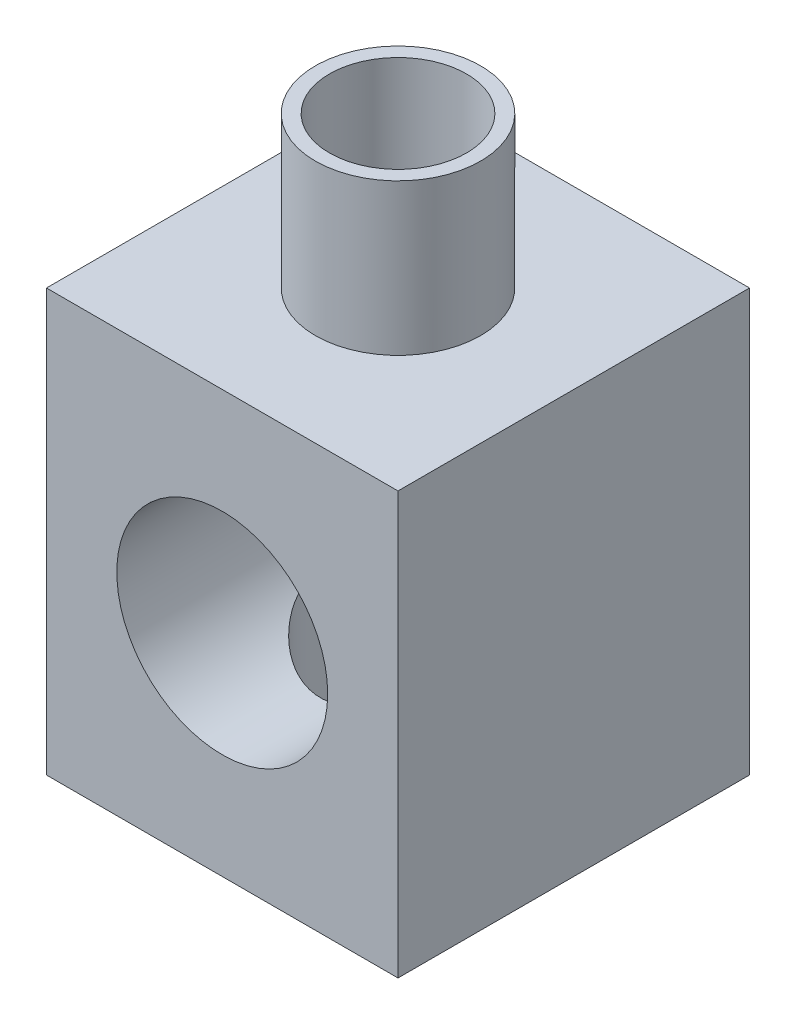
ISO-10303-21;
HEADER;
FILE_DESCRIPTION(('STEP AP214'),'2;1');
FILE_NAME('part.step','',(''),(''),'','','');
FILE_SCHEMA(('AUTOMOTIVE_DESIGN { 1 0 10303 214 1 1 1 1 }'));
ENDSEC;
DATA;
#1=APPLICATION_CONTEXT('core data for automotive mechanical design processes');
#2=APPLICATION_PROTOCOL_DEFINITION('international standard','automotive_design',2000,#1);
#3=PRODUCT_CONTEXT('',#1,'mechanical');
#4=PRODUCT('Part','Part','',(#3));
#5=PRODUCT_RELATED_PRODUCT_CATEGORY('part','',(#4));
#6=PRODUCT_DEFINITION_FORMATION('','',#4);
#7=PRODUCT_DEFINITION_CONTEXT('part definition',#1,'design');
#8=PRODUCT_DEFINITION('design','',#6,#7);
#9=PRODUCT_DEFINITION_SHAPE('','',#8);
#10=(LENGTH_UNIT() NAMED_UNIT(*) SI_UNIT(.MILLI.,.METRE.));
#11=(NAMED_UNIT(*) PLANE_ANGLE_UNIT() SI_UNIT($,.RADIAN.));
#12=(NAMED_UNIT(*) SI_UNIT($,.STERADIAN.) SOLID_ANGLE_UNIT());
#13=UNCERTAINTY_MEASURE_WITH_UNIT(LENGTH_MEASURE(1.E-05),#10,'distance_accuracy_value','');
#14=(GEOMETRIC_REPRESENTATION_CONTEXT(3) GLOBAL_UNCERTAINTY_ASSIGNED_CONTEXT((#13)) GLOBAL_UNIT_ASSIGNED_CONTEXT((#10,
#11,#12)) REPRESENTATION_CONTEXT('',''));
#15=CARTESIAN_POINT('',(0.,0.,0.));
#16=DIRECTION('',(0.,0.,1.));
#17=DIRECTION('',(1.,0.,0.));
#18=AXIS2_PLACEMENT_3D('',#15,#16,#17);
#19=CARTESIAN_POINT('',(0.,0.,0.));
#20=DIRECTION('',(0.,-1.,0.));
#21=DIRECTION('',(0.,0.,-1.));
#22=AXIS2_PLACEMENT_3D('',#19,#20,#21);
#23=PLANE('',#22);
#24=DIRECTION('',(0.,0.,-1.));
#25=VECTOR('',#24,1.);
#26=CARTESIAN_POINT('',(25.,0.,25.));
#27=LINE('',#26,#25);
#28=CARTESIAN_POINT('',(25.,0.,25.));
#29=VERTEX_POINT('',#28);
#30=CARTESIAN_POINT('',(25.,0.,-25.));
#31=VERTEX_POINT('',#30);
#32=EDGE_CURVE('E100',#29,#31,#27,.T.);
#33=ORIENTED_EDGE('',*,*,#32,.F.);
#34=DIRECTION('',(1.,0.,0.));
#35=VECTOR('',#34,1.);
#36=CARTESIAN_POINT('',(-25.,0.,25.));
#37=LINE('',#36,#35);
#38=CARTESIAN_POINT('',(-25.,0.,25.));
#39=VERTEX_POINT('',#38);
#40=EDGE_CURVE('E75',#39,#29,#37,.T.);
#41=ORIENTED_EDGE('',*,*,#40,.F.);
#42=DIRECTION('',(0.,0.,1.));
#43=VECTOR('',#42,1.);
#44=CARTESIAN_POINT('',(-25.,0.,25.));
#45=LINE('',#44,#43);
#46=CARTESIAN_POINT('',(-25.,0.,-25.));
#47=VERTEX_POINT('',#46);
#48=EDGE_CURVE('E69',#47,#39,#45,.T.);
#49=ORIENTED_EDGE('',*,*,#48,.F.);
#50=DIRECTION('',(-1.,0.,0.));
#51=VECTOR('',#50,1.);
#52=CARTESIAN_POINT('',(-25.,0.,-25.));
#53=LINE('',#52,#51);
#54=EDGE_CURVE('E91',#31,#47,#53,.T.);
#55=ORIENTED_EDGE('',*,*,#54,.F.);
#56=EDGE_LOOP('',(#33,#41,#49,#55));
#57=FACE_BOUND('',#56,.T.);
#58=CARTESIAN_POINT('',(0.,0.,0.));
#59=DIRECTION('',(0.,-1.,0.));
#60=DIRECTION('',(0.,0.,-1.));
#61=AXIS2_PLACEMENT_3D('',#58,#59,#60);
#62=CIRCLE('',#61,13.);
#63=CARTESIAN_POINT('',(0.,0.,-13.));
#64=VERTEX_POINT('',#63);
#65=EDGE_CURVE('E222',#64,#64,#62,.T.);
#66=ORIENTED_EDGE('',*,*,#65,.F.);
#67=EDGE_LOOP('',(#66));
#68=FACE_BOUND('',#67,.T.);
#69=ADVANCED_FACE('F33',(#57,#68),#23,.T.);
#70=CARTESIAN_POINT('',(0.,60.,0.));
#71=DIRECTION('',(0.,-1.,0.));
#72=DIRECTION('',(0.,0.,-1.));
#73=AXIS2_PLACEMENT_3D('',#70,#71,#72);
#74=CYLINDRICAL_SURFACE('',#73,11.);
#75=CARTESIAN_POINT('',(0.,45.,-11.));
#76=CARTESIAN_POINT('',(-0.270110744197477,44.9999974608303,-10.9999973598132));
#77=CARTESIAN_POINT('',(-0.540289031083577,44.9926861475496,-10.9900330358975));
#78=CARTESIAN_POINT('',(-1.07852298256454,44.9636061420586,-10.9503281218805));
#79=CARTESIAN_POINT('',(-1.34657728425868,44.9418288249369,-10.9205757337395));
#80=CARTESIAN_POINT('',(-1.87890045413597,44.8842720546229,-10.8416919257174));
#81=CARTESIAN_POINT('',(-2.14315966567923,44.8484618144854,-10.7925178946518));
#82=CARTESIAN_POINT('',(-2.66531023246231,44.763674502164,-10.6755657933803));
#83=CARTESIAN_POINT('',(-2.92320244425288,44.7146992117258,-10.607790240661));
#84=CARTESIAN_POINT('',(-3.42948944014934,44.6049752088188,-10.4550516437199));
#85=CARTESIAN_POINT('',(-3.67793191713288,44.5442988853811,-10.3701941430889));
#86=CARTESIAN_POINT('',(-4.1656309237487,44.4121947207521,-10.1840881835199));
#87=CARTESIAN_POINT('',(-4.40488717106104,44.3407665494561,-10.0828392213221));
#88=CARTESIAN_POINT('',(-4.87303226666782,44.1885203494891,-9.86509828923477));
#89=CARTESIAN_POINT('',(-5.10192760037114,44.1077083108457,-9.74861603731929));
#90=CARTESIAN_POINT('',(-5.54882577953709,43.9379946123471,-9.5013567537479));
#91=CARTESIAN_POINT('',(-5.76682453137718,43.8490899471205,-9.37057440778556));
#92=CARTESIAN_POINT('',(-6.21064733538029,43.656193400344,-9.08317046167074));
#93=CARTESIAN_POINT('',(-6.43537264867267,43.5515649961739,-8.92528014473491));
#94=CARTESIAN_POINT('',(-6.87057511640613,43.3361971657123,-8.59475849888054));
#95=CARTESIAN_POINT('',(-7.08105186451837,43.2254575653102,-8.4221267498952));
#96=CARTESIAN_POINT('',(-7.48771876466872,42.999548106547,-8.06274275394945));
#97=CARTESIAN_POINT('',(-7.68388582881398,42.8843715276567,-7.87596863696921));
#98=CARTESIAN_POINT('',(-8.06122930431745,42.6517078394712,-7.48929574231134));
#99=CARTESIAN_POINT('',(-8.24240850547928,42.5342211652332,-7.28939941964886));
#100=CARTESIAN_POINT('',(-8.6233142410747,42.2760397806092,-6.83682271283393));
#101=CARTESIAN_POINT('',(-8.81979378479981,42.1352758274895,-6.58143814538193));
#102=CARTESIAN_POINT('',(-9.19042709985845,41.8570551079099,-6.05311541619334));
#103=CARTESIAN_POINT('',(-9.36457441779558,41.7195993066941,-5.78017221455917));
#104=CARTESIAN_POINT('',(-9.68936475286764,41.4525262357434,-5.21743671570999));
#105=CARTESIAN_POINT('',(-9.84003382638042,41.3229003755644,-4.92766359410242));
#106=CARTESIAN_POINT('',(-10.1166566012415,41.0764412935123,-4.33141342721813));
#107=CARTESIAN_POINT('',(-10.2426241348075,40.9596009283906,-4.02494585396985));
#108=CARTESIAN_POINT('',(-10.4303849301875,40.7804395515241,-3.50094875371494));
#109=CARTESIAN_POINT('',(-10.4995736032209,40.7129272363569,-3.28782295039842));
#110=CARTESIAN_POINT('',(-10.6254261964559,40.5881146036255,-2.85500892750825));
#111=CARTESIAN_POINT('',(-10.6820940650719,40.5308110678474,-2.63532280159926));
#112=CARTESIAN_POINT('',(-10.7820817039136,40.428415027612,-2.19056144666434));
#113=CARTESIAN_POINT('',(-10.8254262036775,40.3832999192711,-1.96549704776561));
#114=CARTESIAN_POINT('',(-10.8981900385325,40.3069030128415,-1.5107793166227));
#115=CARTESIAN_POINT('',(-10.9276094387772,40.2756211500289,-1.28112600585465));
#116=CARTESIAN_POINT('',(-10.9721120539284,40.228090680293,-0.817016430647307));
#117=CARTESIAN_POINT('',(-10.9870803167889,40.2119626416432,-0.582536566657302));
#118=CARTESIAN_POINT('',(-11.0019364554479,40.1959559553537,-0.112547162599083));
#119=CARTESIAN_POINT('',(-11.0018249298077,40.1960766627533,0.122962336228832));
#120=CARTESIAN_POINT('',(-10.9865202663755,40.2125655147182,0.593051318056399));
#121=CARTESIAN_POINT('',(-10.9713182555288,40.2289432182349,0.827630172372136));
#122=CARTESIAN_POINT('',(-10.9261644825523,40.2771595262055,1.29374903509207));
#123=CARTESIAN_POINT('',(-10.8962110829152,40.3089998471127,1.52528870319514));
#124=CARTESIAN_POINT('',(-10.8181280568705,40.3909399355534,2.00856284757364));
#125=CARTESIAN_POINT('',(-10.7683790418364,40.4426459109178,2.25976300863489));
#126=CARTESIAN_POINT('',(-10.652520392373,40.5608077917485,2.75472275291847));
#127=CARTESIAN_POINT('',(-10.5864084566221,40.6272657718373,2.99848128410992));
#128=CARTESIAN_POINT('',(-10.364772215534,40.8450085016431,3.71799867113453));
#129=CARTESIAN_POINT('',(-10.1860597630495,41.0145359650604,4.18133017627947));
#130=CARTESIAN_POINT('',(-9.8411703503398,41.3219346670771,4.92553974275099));
#131=CARTESIAN_POINT('',(-9.68976441919441,41.4522116638623,5.21681177433259));
#132=CARTESIAN_POINT('',(-9.36334099036477,41.7205994354936,5.7822415570141));
#133=CARTESIAN_POINT('',(-9.1883158317063,41.858712743614,6.05639371284691));
#134=CARTESIAN_POINT('',(-8.81551764459025,42.1384116731292,6.5872600446896));
#135=CARTESIAN_POINT('',(-8.61772346084422,42.2800004259911,6.84395764525848));
#136=CARTESIAN_POINT('',(-8.20017083391706,42.5626731720633,7.33907558108593));
#137=CARTESIAN_POINT('',(-7.98041489964976,42.7037572210279,7.57749799861803));
#138=CARTESIAN_POINT('',(-7.51615333610881,42.983912732607,8.03840395938117));
#139=CARTESIAN_POINT('',(-7.27134120874007,43.1229273748925,8.26061387485754));
#140=CARTESIAN_POINT('',(-6.76014190729572,43.3934351502863,8.68392747509128));
#141=CARTESIAN_POINT('',(-6.49375243104769,43.5249274782486,8.88502890243165));
#142=CARTESIAN_POINT('',(-5.94075048317126,43.7767782862489,9.26388670594736));
#143=CARTESIAN_POINT('',(-5.6541783280695,43.8971579117117,9.44168770098712));
#144=CARTESIAN_POINT('',(-5.06162496703923,44.1237549894301,9.772150015994));
#145=CARTESIAN_POINT('',(-4.75565109783594,44.2299777485021,9.92482076131319));
#146=CARTESIAN_POINT('',(-4.20679991040777,44.4001034413105,10.1670234614025));
#147=CARTESIAN_POINT('',(-3.96782078515358,44.4678790152882,10.2627137403946));
#148=CARTESIAN_POINT('',(-3.48124329882184,44.5926000635484,10.4378042311076));
#149=CARTESIAN_POINT('',(-3.23364685730742,44.6495479317356,10.5172080439209));
#150=CARTESIAN_POINT('',(-2.73127838202087,44.7514667945713,10.6587138232829));
#151=CARTESIAN_POINT('',(-2.47651015327192,44.7964440126414,10.7208247809921));
#152=CARTESIAN_POINT('',(-1.96128766488453,44.8735062826463,10.8269349755309));
#153=CARTESIAN_POINT('',(-1.70083325971851,44.9055910042116,10.8709337482377));
#154=CARTESIAN_POINT('',(-1.17508411102072,44.9562425011795,10.940281264288));
#155=CARTESIAN_POINT('',(-0.909774316596427,44.9747554033694,10.9655556856344));
#156=CARTESIAN_POINT('',(-0.377406380703509,44.9976179736679,10.9967567120282));
#157=CARTESIAN_POINT('',(-0.110348241893038,45.001967663305,11.0026833464849));
#158=CARTESIAN_POINT('',(0.423344197860635,44.9963995178058,10.9950900302047));
#159=CARTESIAN_POINT('',(0.689978491736684,44.9864814472171,10.9815697585472));
#160=CARTESIAN_POINT('',(1.22066272749612,44.9526142327057,10.9353061623393));
#161=CARTESIAN_POINT('',(1.4847127469152,44.9286655110634,10.9025634163272));
#162=CARTESIAN_POINT('',(1.99230010982735,44.8691638529147,10.8209408699265));
#163=CARTESIAN_POINT('',(2.23610939080497,44.8344038983366,10.7731617380553));
#164=CARTESIAN_POINT('',(2.71816244025099,44.7536881426195,10.6617441545321));
#165=CARTESIAN_POINT('',(2.95640648231444,44.7077328931317,10.5981064843105));
#166=CARTESIAN_POINT('',(3.42603301999851,44.6054802709523,10.4557403377154));
#167=CARTESIAN_POINT('',(3.6574159053783,44.5491834870404,10.3770127204546));
#168=CARTESIAN_POINT('',(4.11235082689498,44.4271987050362,10.2052788171933));
#169=CARTESIAN_POINT('',(4.33589994377809,44.3615072513952,10.1122672763448));
#170=CARTESIAN_POINT('',(4.79159787740789,44.2162658396186,9.90495398664861));
#171=CARTESIAN_POINT('',(5.02302608318197,44.1360304158281,9.78954961237338));
#172=CARTESIAN_POINT('',(5.4749512770416,43.9672162180581,9.54416372382621));
#173=CARTESIAN_POINT('',(5.69544366423045,43.8786339771155,9.41417614791346));
#174=CARTESIAN_POINT('',(6.12486520015845,43.6945468035205,9.14061564171081));
#175=CARTESIAN_POINT('',(6.33379159958489,43.5990402372648,8.99703950311911));
#176=CARTESIAN_POINT('',(6.73962347311303,43.4025489444866,8.6971917133044));
#177=CARTESIAN_POINT('',(6.93652745590328,43.3015635412682,8.5409184926626));
#178=CARTESIAN_POINT('',(7.35294580934229,43.0766950252305,8.1866951979862));
#179=CARTESIAN_POINT('',(7.56999539027636,42.9520059139339,7.98635432383585));
#180=CARTESIAN_POINT('',(7.98643942077465,42.6994528355065,7.56990923706893));
#181=CARTESIAN_POINT('',(8.18583116706011,42.5715883860792,7.35380262004251));
#182=CARTESIAN_POINT('',(8.56673045749969,42.3151888067265,6.90634040492952));
#183=CARTESIAN_POINT('',(8.7482217973263,42.1866531780389,6.6749713009497));
#184=CARTESIAN_POINT('',(9.09263414138609,41.9318844928923,6.19762981055959));
#185=CARTESIAN_POINT('',(9.25555735428008,41.8056511640805,5.9516591662931));
#186=CARTESIAN_POINT('',(9.5466769720951,41.5711830663914,5.47098857588198));
#187=CARTESIAN_POINT('',(9.67671904693761,41.4624191630785,5.23766462148889));
#188=CARTESIAN_POINT('',(9.92061312961937,41.2519941371151,4.75956357248533));
#189=CARTESIAN_POINT('',(10.0344643903335,41.1503333423477,4.51478595003758));
#190=CARTESIAN_POINT('',(10.2448778133162,40.9573187225254,4.01447427504347));
#191=CARTESIAN_POINT('',(10.3414679144767,40.8659483317442,3.7589584469144));
#192=CARTESIAN_POINT('',(10.5163951645491,40.696740456234,3.23743689867137));
#193=CARTESIAN_POINT('',(10.5947399798539,40.6188972910718,2.97143563951238));
#194=CARTESIAN_POINT('',(10.7161005953447,40.4962293358489,2.49227930580472));
#195=CARTESIAN_POINT('',(10.7630978451311,40.4479273474125,2.28101908894396));
#196=CARTESIAN_POINT('',(10.8448258259195,40.3630705776004,1.85390952792791));
#197=CARTESIAN_POINT('',(10.8795637486937,40.3265089100588,1.63806295336276));
#198=CARTESIAN_POINT('',(10.9362045600377,40.266505757041,1.20310813816774));
#199=CARTESIAN_POINT('',(10.9581212707429,40.2430501435791,0.984003672139265));
#200=CARTESIAN_POINT('',(10.9887642181428,40.2101700764594,0.543810890515307));
#201=CARTESIAN_POINT('',(10.9974904225618,40.2007456571346,0.322722570066859));
#202=CARTESIAN_POINT('',(11.001577730153,40.1963374779368,-0.120236354253128));
#203=CARTESIAN_POINT('',(10.9969078378347,40.2013872078989,-0.342107584095333));
#204=CARTESIAN_POINT('',(10.974233744487,40.2257745530489,-0.784363706971924));
#205=CARTESIAN_POINT('',(10.9562296255898,40.2451120802309,-1.00474860915293));
#206=CARTESIAN_POINT('',(10.9072123246648,40.297280820028,-1.44267986976684));
#207=CARTESIAN_POINT('',(10.8761849079364,40.3301267968282,-1.66022285283719));
#208=CARTESIAN_POINT('',(10.8016529141427,40.408034823447,-2.09095661163474));
#209=CARTESIAN_POINT('',(10.758145127813,40.453100015212,-2.30414625279833));
#210=CARTESIAN_POINT('',(10.6451091285833,40.5683441570994,-2.78550384026919));
#211=CARTESIAN_POINT('',(10.5716973186313,40.6420191713655,-3.0519263332905));
#212=CARTESIAN_POINT('',(10.4066007199771,40.8035167601752,-3.57461208753826));
#213=CARTESIAN_POINT('',(10.3149103503141,40.8913436541136,-3.83087221718635));
#214=CARTESIAN_POINT('',(10.1142364448847,41.0779522214145,-4.3330705541883));
#215=CARTESIAN_POINT('',(10.0052156009968,41.1767573868237,-4.57898501158382));
#216=CARTESIAN_POINT('',(9.77098939880929,41.3820926684221,-5.05956860434713));
#217=CARTESIAN_POINT('',(9.64578370411759,41.4886229451528,-5.29423750584396));
#218=CARTESIAN_POINT('',(9.34379854918015,41.7363189510665,-5.81436004275057));
#219=CARTESIAN_POINT('',(9.16224442693568,41.879037851564,-6.09631113298266));
#220=CARTESIAN_POINT('',(8.77512208496417,42.1678098142591,-6.64146271614016));
#221=CARTESIAN_POINT('',(8.56954728756618,42.3138637808596,-6.90465804119156));
#222=CARTESIAN_POINT('',(8.13522031697478,42.6050194061752,-7.41144266146274));
#223=CARTESIAN_POINT('',(7.90648153236523,42.7501215639646,-7.65504313787453));
#224=CARTESIAN_POINT('',(7.42631302236132,43.0356382882479,-8.12169325353109));
#225=CARTESIAN_POINT('',(7.17488901333287,43.1760540235067,-8.34474804153731));
#226=CARTESIAN_POINT('',(6.69115256817232,43.4272359227161,-8.73552414547329));
#227=CARTESIAN_POINT('',(6.46203294364468,43.5391969321934,-8.90643572676668));
#228=CARTESIAN_POINT('',(5.98860620208572,43.7551538545753,-9.2314137838971));
#229=CARTESIAN_POINT('',(5.74430158432136,43.8591510719681,-9.38548302032597));
#230=CARTESIAN_POINT('',(5.24139468689524,44.0570534959253,-9.6753269703283));
#231=CARTESIAN_POINT('',(4.98280222880867,44.1509655075815,-9.81111403587453));
#232=CARTESIAN_POINT('',(4.45226540129276,44.3267362752663,-10.0629771089296));
#233=CARTESIAN_POINT('',(4.18032354579017,44.408597289187,-10.1790568094647));
#234=CARTESIAN_POINT('',(3.66616342350025,44.5471359201621,-10.3741573451725));
#235=CARTESIAN_POINT('',(3.42558156937486,44.6057488698396,-10.4561241668229));
#236=CARTESIAN_POINT('',(2.93706315480403,44.7117672617522,-10.6037132524074));
#237=CARTESIAN_POINT('',(2.68912794268373,44.759174744517,-10.6693384922809));
#238=CARTESIAN_POINT('',(2.18787416914334,44.8417517724116,-10.7832802445943));
#239=CARTESIAN_POINT('',(1.93456816798543,44.8769471110713,-10.8316332445519));
#240=CARTESIAN_POINT('',(1.42384932104133,44.9344774108996,-10.9105154998498));
#241=CARTESIAN_POINT('',(1.16643872476616,44.9568191832511,-10.9410541952181));
#242=CARTESIAN_POINT('',(0.75712601817307,44.9816426567374,-10.9749569849538));
#243=CARTESIAN_POINT('',(0.605954225695025,44.9885206400486,-10.984342017959));
#244=CARTESIAN_POINT('',(0.303195414754704,44.9977003111228,-10.996864658023));
#245=CARTESIAN_POINT('',(0.151608346623402,45.0000014251907,-11.0000014818898));
#246=CARTESIAN_POINT('',(0.,45.,-11.));
#247=B_SPLINE_CURVE_WITH_KNOTS('',3,(#75,#76,#77,#78,#79,#80,#81,#82,#83,#84,#85,#86,#87,#88,
#89,#90,#91,#92,#93,#94,#95,#96,#97,#98,#99,#100,#101,#102,#103,#104,#105,#106,#107,#108,#109,
#110,#111,#112,#113,#114,#115,#116,#117,#118,#119,#120,#121,#122,#123,#124,#125,#126,#127,#128,
#129,#130,#131,#132,#133,#134,#135,#136,#137,#138,#139,#140,#141,#142,#143,#144,#145,#146,#147,
#148,#149,#150,#151,#152,#153,#154,#155,#156,#157,#158,#159,#160,#161,#162,#163,#164,#165,#166,
#167,#168,#169,#170,#171,#172,#173,#174,#175,#176,#177,#178,#179,#180,#181,#182,#183,#184,#185,
#186,#187,#188,#189,#190,#191,#192,#193,#194,#195,#196,#197,#198,#199,#200,#201,#202,#203,#204,
#205,#206,#207,#208,#209,#210,#211,#212,#213,#214,#215,#216,#217,#218,#219,#220,#221,#222,#223,
#224,#225,#226,#227,#228,#229,#230,#231,#232,#233,#234,#235,#236,#237,#238,#239,#240,#241,#242,
#243,#244,#245,#246),.UNSPECIFIED.,.T.,.F.,(4,2,2,2,2,2,2,2,2,2,2,2,2,2,2,2,2,2,2,2,2,2,2,2,2,2,
2,2,2,2,2,2,2,2,2,2,2,2,2,2,2,2,2,2,2,2,2,2,2,2,2,2,2,2,2,2,2,2,2,2,2,2,2,2,2,2,2,2,2,2,2,2,2,2,
2,2,2,2,2,2,2,2,2,2,2,4),(0.,0.810169357085883,1.62082218688859,2.43326356231595,
3.24559503799466,4.05305348505196,4.86053672785752,5.66750733237119,6.47477885511227,
7.35565368833111,8.23655363103995,9.11884478509551,10.0009713403942,11.054678178616,
12.1086888261328,13.1615212611752,14.2137624433261,14.915276753358,15.6165695253124,
16.3165526545416,17.016532508614,17.7220355879629,18.4275106638218,19.1334007978426,
19.8393693082743,20.6219285659296,21.4045979472486,22.9719812598272,24.0304407604573,
25.0892444048054,26.1490398743093,27.2087144107119,28.2833999281832,29.3582002595085,
30.4309113659766,31.5032192201074,32.3010322348245,33.0986686548839,33.8958895780711,
34.6931309286872,35.4935200351391,36.2939079249769,37.0943090232898,37.8946860331837,
38.646459903409,39.3981967372506,40.1498907853306,40.9018620361347,41.7133743758931,
42.5252252867152,43.3372683585193,44.1494119557932,45.1103152385431,46.071365374808,
47.033277666074,47.9950754191168,48.8596018773335,49.7241682161878,50.5873222378104,
51.4501129181483,52.1147349620882,52.7789664636287,53.4424805526333,54.1059962651878,
54.7710484380972,55.4360965146436,56.1018734015416,56.7678216433323,57.6245407809539,
58.4815219008917,59.3403735107737,60.199242974229,61.2912128551912,62.3834824582019,
63.4751243036081,64.5664918343885,65.4865880398675,66.4065332075521,67.325853680381,
68.2450016881881,69.0266992912611,69.8082544363545,70.5881486477637,71.3676292069321,
71.822305839083,72.2770394598343),.UNSPECIFIED.);
#248=CARTESIAN_POINT('',(0.,45.,-11.));
#249=VERTEX_POINT('',#248);
#250=EDGE_CURVE('E103',#249,#249,#247,.T.);
#251=ORIENTED_EDGE('',*,*,#250,.F.);
#252=EDGE_LOOP('',(#251));
#253=FACE_BOUND('',#252,.T.);
#254=CARTESIAN_POINT('',(0.,55.,0.));
#255=DIRECTION('',(0.,1.,0.));
#256=DIRECTION('',(0.,0.,1.));
#257=AXIS2_PLACEMENT_3D('',#254,#255,#256);
#258=CIRCLE('',#257,11.);
#259=CARTESIAN_POINT('',(0.,55.,11.));
#260=VERTEX_POINT('',#259);
#261=EDGE_CURVE('E37',#260,#260,#258,.T.);
#262=ORIENTED_EDGE('',*,*,#261,.T.);
#263=EDGE_LOOP('',(#262));
#264=FACE_BOUND('',#263,.T.);
#265=ADVANCED_FACE('F167',(#253,#264),#74,.F.);
#266=CARTESIAN_POINT('',(0.,60.,0.));
#267=DIRECTION('',(0.,-1.,0.));
#268=DIRECTION('',(0.,0.,-1.));
#269=AXIS2_PLACEMENT_3D('',#266,#267,#268);
#270=PLANE('',#269);
#271=CARTESIAN_POINT('',(0.,60.,0.));
#272=DIRECTION('',(0.,-1.,0.));
#273=DIRECTION('',(0.,0.,-1.));
#274=AXIS2_PLACEMENT_3D('',#271,#272,#273);
#275=CIRCLE('',#274,11.75);
#276=CARTESIAN_POINT('',(0.,60.,-11.75));
#277=VERTEX_POINT('',#276);
#278=EDGE_CURVE('E198',#277,#277,#275,.T.);
#279=ORIENTED_EDGE('',*,*,#278,.T.);
#280=EDGE_LOOP('',(#279));
#281=FACE_BOUND('',#280,.T.);
#282=DIRECTION('',(0.,0.,-1.));
#283=VECTOR('',#282,1.);
#284=CARTESIAN_POINT('',(25.,60.,25.));
#285=LINE('',#284,#283);
#286=CARTESIAN_POINT('',(25.,60.,25.));
#287=VERTEX_POINT('',#286);
#288=CARTESIAN_POINT('',(25.,60.,-25.));
#289=VERTEX_POINT('',#288);
#290=EDGE_CURVE('E87',#287,#289,#285,.T.);
#291=ORIENTED_EDGE('',*,*,#290,.T.);
#292=DIRECTION('',(-1.,0.,0.));
#293=VECTOR('',#292,1.);
#294=CARTESIAN_POINT('',(-25.,60.,-25.));
#295=LINE('',#294,#293);
#296=CARTESIAN_POINT('',(-25.,60.,-25.));
#297=VERTEX_POINT('',#296);
#298=EDGE_CURVE('E82',#289,#297,#295,.T.);
#299=ORIENTED_EDGE('',*,*,#298,.T.);
#300=DIRECTION('',(0.,0.,1.));
#301=VECTOR('',#300,1.);
#302=CARTESIAN_POINT('',(-25.,60.,25.));
#303=LINE('',#302,#301);
#304=CARTESIAN_POINT('',(-25.,60.,25.));
#305=VERTEX_POINT('',#304);
#306=EDGE_CURVE('E85',#297,#305,#303,.T.);
#307=ORIENTED_EDGE('',*,*,#306,.T.);
#308=DIRECTION('',(1.,0.,0.));
#309=VECTOR('',#308,1.);
#310=CARTESIAN_POINT('',(-25.,60.,25.));
#311=LINE('',#310,#309);
#312=EDGE_CURVE('E52',#305,#287,#311,.T.);
#313=ORIENTED_EDGE('',*,*,#312,.T.);
#314=EDGE_LOOP('',(#291,#299,#307,#313));
#315=FACE_BOUND('',#314,.T.);
#316=ADVANCED_FACE('F83',(#281,#315),#270,.F.);
#317=CARTESIAN_POINT('',(25.,60.,25.));
#318=DIRECTION('',(-1.,0.,0.));
#319=DIRECTION('',(0.,0.,1.));
#320=AXIS2_PLACEMENT_3D('',#317,#318,#319);
#321=PLANE('',#320);
#322=ORIENTED_EDGE('',*,*,#32,.T.);
#323=DIRECTION('',(0.,-1.,0.));
#324=VECTOR('',#323,1.);
#325=CARTESIAN_POINT('',(25.,60.,-25.));
#326=LINE('',#325,#324);
#327=EDGE_CURVE('E11',#289,#31,#326,.T.);
#328=ORIENTED_EDGE('',*,*,#327,.F.);
#329=ORIENTED_EDGE('',*,*,#290,.F.);
#330=DIRECTION('',(0.,-1.,0.));
#331=VECTOR('',#330,1.);
#332=CARTESIAN_POINT('',(25.,60.,25.));
#333=LINE('',#332,#331);
#334=EDGE_CURVE('E96',#287,#29,#333,.T.);
#335=ORIENTED_EDGE('',*,*,#334,.T.);
#336=EDGE_LOOP('',(#322,#328,#329,#335));
#337=FACE_BOUND('',#336,.T.);
#338=ADVANCED_FACE('F35',(#337),#321,.F.);
#339=CARTESIAN_POINT('',(-25.,60.,-25.));
#340=DIRECTION('',(0.,0.,1.));
#341=DIRECTION('',(1.,0.,0.));
#342=AXIS2_PLACEMENT_3D('',#339,#340,#341);
#343=PLANE('',#342);
#344=CARTESIAN_POINT('',(0.,30.,-25.));
#345=DIRECTION('',(0.,0.,1.));
#346=DIRECTION('',(1.,0.,0.));
#347=AXIS2_PLACEMENT_3D('',#344,#345,#346);
#348=CIRCLE('',#347,4.);
#349=CARTESIAN_POINT('',(4.,30.,-25.));
#350=VERTEX_POINT('',#349);
#351=EDGE_CURVE('E190',#350,#350,#348,.T.);
#352=ORIENTED_EDGE('',*,*,#351,.T.);
#353=EDGE_LOOP('',(#352));
#354=FACE_BOUND('',#353,.T.);
#355=ORIENTED_EDGE('',*,*,#54,.T.);
#356=DIRECTION('',(0.,-1.,0.));
#357=VECTOR('',#356,1.);
#358=CARTESIAN_POINT('',(-25.,60.,-25.));
#359=LINE('',#358,#357);
#360=EDGE_CURVE('E43',#297,#47,#359,.T.);
#361=ORIENTED_EDGE('',*,*,#360,.F.);
#362=ORIENTED_EDGE('',*,*,#298,.F.);
#363=ORIENTED_EDGE('',*,*,#327,.T.);
#364=EDGE_LOOP('',(#355,#361,#362,#363));
#365=FACE_BOUND('',#364,.T.);
#366=ADVANCED_FACE('F90',(#354,#365),#343,.F.);
#367=CARTESIAN_POINT('',(-25.,60.,25.));
#368=DIRECTION('',(1.,0.,0.));
#369=DIRECTION('',(0.,0.,-1.));
#370=AXIS2_PLACEMENT_3D('',#367,#368,#369);
#371=PLANE('',#370);
#372=ORIENTED_EDGE('',*,*,#48,.T.);
#373=DIRECTION('',(0.,-1.,0.));
#374=VECTOR('',#373,1.);
#375=CARTESIAN_POINT('',(-25.,60.,25.));
#376=LINE('',#375,#374);
#377=EDGE_CURVE('E92',#305,#39,#376,.T.);
#378=ORIENTED_EDGE('',*,*,#377,.F.);
#379=ORIENTED_EDGE('',*,*,#306,.F.);
#380=ORIENTED_EDGE('',*,*,#360,.T.);
#381=EDGE_LOOP('',(#372,#378,#379,#380));
#382=FACE_BOUND('',#381,.T.);
#383=ADVANCED_FACE('F94',(#382),#371,.F.);
#384=CARTESIAN_POINT('',(-25.,60.,25.));
#385=DIRECTION('',(0.,0.,-1.));
#386=DIRECTION('',(-1.,0.,0.));
#387=AXIS2_PLACEMENT_3D('',#384,#385,#386);
#388=PLANE('',#387);
#389=CARTESIAN_POINT('',(0.,30.,25.));
#390=DIRECTION('',(0.,0.,1.));
#391=DIRECTION('',(1.,0.,0.));
#392=AXIS2_PLACEMENT_3D('',#389,#390,#391);
#393=CIRCLE('',#392,15.);
#394=CARTESIAN_POINT('',(15.,30.,25.));
#395=VERTEX_POINT('',#394);
#396=EDGE_CURVE('E192',#395,#395,#393,.T.);
#397=ORIENTED_EDGE('',*,*,#396,.F.);
#398=EDGE_LOOP('',(#397));
#399=FACE_BOUND('',#398,.T.);
#400=ORIENTED_EDGE('',*,*,#40,.T.);
#401=ORIENTED_EDGE('',*,*,#334,.F.);
#402=ORIENTED_EDGE('',*,*,#312,.F.);
#403=ORIENTED_EDGE('',*,*,#377,.T.);
#404=EDGE_LOOP('',(#400,#401,#402,#403));
#405=FACE_BOUND('',#404,.T.);
#406=ADVANCED_FACE('F177',(#399,#405),#388,.F.);
#407=CARTESIAN_POINT('',(0.,15.,-11.));
#408=CARTESIAN_POINT('',(0.270110744197477,15.0000025391697,-10.9999973598132));
#409=CARTESIAN_POINT('',(0.540289031083577,15.0073138524504,-10.9900330358975));
#410=CARTESIAN_POINT('',(1.07852298256454,15.0363938579414,-10.9503281218805));
#411=CARTESIAN_POINT('',(1.34657728425868,15.0581711750631,-10.9205757337395));
#412=CARTESIAN_POINT('',(1.87890045413597,15.1157279453771,-10.8416919257174));
#413=CARTESIAN_POINT('',(2.14315966567923,15.1515381855146,-10.7925178946518));
#414=CARTESIAN_POINT('',(2.66531023246231,15.236325497836,-10.6755657933803));
#415=CARTESIAN_POINT('',(2.92320244425288,15.2853007882742,-10.607790240661));
#416=CARTESIAN_POINT('',(3.42948944014933,15.3950247911812,-10.4550516437199));
#417=CARTESIAN_POINT('',(3.67793191713288,15.4557011146189,-10.3701941430889));
#418=CARTESIAN_POINT('',(4.1656309237487,15.5878052792479,-10.1840881835199));
#419=CARTESIAN_POINT('',(4.40488717106104,15.6592334505439,-10.0828392213221));
#420=CARTESIAN_POINT('',(4.87303226666782,15.8114796505109,-9.86509828923478));
#421=CARTESIAN_POINT('',(5.10192760037114,15.8922916891543,-9.74861603731929));
#422=CARTESIAN_POINT('',(5.54882577953709,16.0620053876529,-9.5013567537479));
#423=CARTESIAN_POINT('',(5.76682453137718,16.1509100528795,-9.37057440778556));
#424=CARTESIAN_POINT('',(6.21064733538029,16.343806599656,-9.08317046167074));
#425=CARTESIAN_POINT('',(6.43537264867267,16.4484350038261,-8.92528014473491));
#426=CARTESIAN_POINT('',(6.87057511640613,16.6638028342877,-8.59475849888054));
#427=CARTESIAN_POINT('',(7.08105186451838,16.7745424346898,-8.4221267498952));
#428=CARTESIAN_POINT('',(7.48771876466872,17.000451893453,-8.06274275394945));
#429=CARTESIAN_POINT('',(7.68388582881399,17.1156284723433,-7.87596863696921));
#430=CARTESIAN_POINT('',(8.06122930431745,17.3482921605288,-7.48929574231134));
#431=CARTESIAN_POINT('',(8.24240850547928,17.4657788347668,-7.28939941964886));
#432=CARTESIAN_POINT('',(8.6233142410747,17.7239602193908,-6.83682271283392));
#433=CARTESIAN_POINT('',(8.81979378479981,17.8647241725105,-6.58143814538193));
#434=CARTESIAN_POINT('',(9.19042709985846,18.1429448920901,-6.05311541619334));
#435=CARTESIAN_POINT('',(9.36457441779559,18.2804006933059,-5.78017221455917));
#436=CARTESIAN_POINT('',(9.68936475286764,18.5474737642566,-5.21743671570999));
#437=CARTESIAN_POINT('',(9.84003382638042,18.6770996244356,-4.92766359410242));
#438=CARTESIAN_POINT('',(10.1166566012415,18.9235587064877,-4.33141342721813));
#439=CARTESIAN_POINT('',(10.2426241348075,19.0403990716094,-4.02494585396985));
#440=CARTESIAN_POINT('',(10.4303849301875,19.2195604484759,-3.50094875371494));
#441=CARTESIAN_POINT('',(10.4995736032209,19.2870727636431,-3.28782295039842));
#442=CARTESIAN_POINT('',(10.6254261964559,19.4118853963745,-2.85500892750825));
#443=CARTESIAN_POINT('',(10.6820940650719,19.4691889321526,-2.63532280159926));
#444=CARTESIAN_POINT('',(10.7820817039136,19.571584972388,-2.19056144666434));
#445=CARTESIAN_POINT('',(10.8254262036775,19.6167000807289,-1.96549704776561));
#446=CARTESIAN_POINT('',(10.8981900385325,19.6930969871585,-1.5107793166227));
#447=CARTESIAN_POINT('',(10.9276094387772,19.7243788499711,-1.28112600585465));
#448=CARTESIAN_POINT('',(10.9721120539284,19.771909319707,-0.81701643064731));
#449=CARTESIAN_POINT('',(10.9870803167889,19.7880373583568,-0.582536566657305));
#450=CARTESIAN_POINT('',(11.0019364554479,19.8040440446463,-0.112547162599087));
#451=CARTESIAN_POINT('',(11.0018249298077,19.8039233372467,0.122962336228828));
#452=CARTESIAN_POINT('',(10.9865202663755,19.7874344852818,0.593051318056394));
#453=CARTESIAN_POINT('',(10.9713182555288,19.7710567817651,0.82763017237213));
#454=CARTESIAN_POINT('',(10.9261644825523,19.7228404737945,1.29374903509207));
#455=CARTESIAN_POINT('',(10.8962110829152,19.6910001528873,1.52528870319514));
#456=CARTESIAN_POINT('',(10.8181280568705,19.6090600644466,2.00856284757364));
#457=CARTESIAN_POINT('',(10.7683790418364,19.5573540890822,2.25976300863489));
#458=CARTESIAN_POINT('',(10.652520392373,19.4391922082515,2.75472275291847));
#459=CARTESIAN_POINT('',(10.5864084566222,19.3727342281627,2.99848128410991));
#460=CARTESIAN_POINT('',(10.364772215534,19.1549914983569,3.71799867113453));
#461=CARTESIAN_POINT('',(10.1860597630495,18.9854640349396,4.18133017627946));
#462=CARTESIAN_POINT('',(9.84117035033981,18.6780653329229,4.92553974275098));
#463=CARTESIAN_POINT('',(9.68976441919442,18.5477883361377,5.21681177433258));
#464=CARTESIAN_POINT('',(9.36334099036478,18.2794005645064,5.78224155701408));
#465=CARTESIAN_POINT('',(9.18831583170631,18.141287256386,6.0563937128469));
#466=CARTESIAN_POINT('',(8.81551764459026,17.8615883268708,6.58726004468959));
#467=CARTESIAN_POINT('',(8.61772346084423,17.7199995740089,6.84395764525847));
#468=CARTESIAN_POINT('',(8.20017083391707,17.4373268279367,7.33907558108592));
#469=CARTESIAN_POINT('',(7.98041489964977,17.2962427789721,7.57749799861801));
#470=CARTESIAN_POINT('',(7.51615333610883,17.016087267393,8.03840395938115));
#471=CARTESIAN_POINT('',(7.27134120874008,16.8770726251075,8.26061387485753));
#472=CARTESIAN_POINT('',(6.76014190729573,16.6065648497137,8.68392747509127));
#473=CARTESIAN_POINT('',(6.4937524310477,16.4750725217514,8.88502890243164));
#474=CARTESIAN_POINT('',(5.94075048317128,16.2232217137511,9.26388670594735));
#475=CARTESIAN_POINT('',(5.65417832806952,16.1028420882883,9.44168770098711));
#476=CARTESIAN_POINT('',(5.06162496703924,15.8762450105699,9.77215001599399));
#477=CARTESIAN_POINT('',(4.75565109783595,15.7700222514979,9.92482076131318));
#478=CARTESIAN_POINT('',(4.20679991040778,15.5998965586895,10.1670234614025));
#479=CARTESIAN_POINT('',(3.96782078515359,15.5321209847118,10.2627137403946));
#480=CARTESIAN_POINT('',(3.48124329882186,15.4073999364516,10.4378042311076));
#481=CARTESIAN_POINT('',(3.23364685730743,15.3504520682644,10.5172080439209));
#482=CARTESIAN_POINT('',(2.73127838202088,15.2485332054287,10.6587138232829));
#483=CARTESIAN_POINT('',(2.47651015327193,15.2035559873586,10.7208247809921));
#484=CARTESIAN_POINT('',(1.96128766488454,15.1264937173537,10.8269349755309));
#485=CARTESIAN_POINT('',(1.70083325971852,15.0944089957884,10.8709337482377));
#486=CARTESIAN_POINT('',(1.17508411102074,15.0437574988204,10.940281264288));
#487=CARTESIAN_POINT('',(0.909774316596437,15.0252445966306,10.9655556856344));
#488=CARTESIAN_POINT('',(0.377406380703518,15.0023820263321,10.9967567120282));
#489=CARTESIAN_POINT('',(0.110348241893049,14.998032336695,11.0026833464849));
#490=CARTESIAN_POINT('',(-0.423344197860622,15.0036004821942,10.9950900302047));
#491=CARTESIAN_POINT('',(-0.689978491736671,15.0135185527829,10.9815697585472));
#492=CARTESIAN_POINT('',(-1.22066272749611,15.0473857672943,10.9353061623393));
#493=CARTESIAN_POINT('',(-1.48471274691519,15.0713344889366,10.9025634163273));
#494=CARTESIAN_POINT('',(-1.99230010982734,15.1308361470853,10.8209408699265));
#495=CARTESIAN_POINT('',(-2.23610939080496,15.1655961016634,10.7731617380553));
#496=CARTESIAN_POINT('',(-2.71816244025098,15.2463118573805,10.6617441545321));
#497=CARTESIAN_POINT('',(-2.95640648231443,15.2922671068683,10.5981064843105));
#498=CARTESIAN_POINT('',(-3.4260330199985,15.3945197290477,10.4557403377154));
#499=CARTESIAN_POINT('',(-3.65741590537829,15.4508165129596,10.3770127204546));
#500=CARTESIAN_POINT('',(-4.11235082689497,15.5728012949638,10.2052788171933));
#501=CARTESIAN_POINT('',(-4.33589994377808,15.6384927486047,10.1122672763448));
#502=CARTESIAN_POINT('',(-4.79159787740788,15.7837341603814,9.90495398664862));
#503=CARTESIAN_POINT('',(-5.02302608318196,15.8639695841719,9.78954961237339));
#504=CARTESIAN_POINT('',(-5.47495127704158,16.0327837819419,9.54416372382622));
#505=CARTESIAN_POINT('',(-5.69544366423043,16.1213660228845,9.41417614791347));
#506=CARTESIAN_POINT('',(-6.12486520015844,16.3054531964795,9.14061564171082));
#507=CARTESIAN_POINT('',(-6.33379159958489,16.4009597627352,8.99703950311911));
#508=CARTESIAN_POINT('',(-6.73962347311303,16.5974510555134,8.6971917133044));
#509=CARTESIAN_POINT('',(-6.93652745590328,16.6984364587318,8.54091849266261));
#510=CARTESIAN_POINT('',(-7.35294580934228,16.9233049747695,8.18669519798621));
#511=CARTESIAN_POINT('',(-7.56999539027635,17.0479940860661,7.98635432383586));
#512=CARTESIAN_POINT('',(-7.98643942077464,17.3005471644935,7.56990923706895));
#513=CARTESIAN_POINT('',(-8.1858311670601,17.4284116139208,7.35380262004252));
#514=CARTESIAN_POINT('',(-8.56673045749968,17.6848111932735,6.90634040492953));
#515=CARTESIAN_POINT('',(-8.74822179732629,17.8133468219611,6.67497130094971));
#516=CARTESIAN_POINT('',(-9.09263414138608,18.0681155071077,6.1976298105596));
#517=CARTESIAN_POINT('',(-9.25555735428007,18.1943488359195,5.95165916629311));
#518=CARTESIAN_POINT('',(-9.54667697209509,18.4288169336086,5.47098857588199));
#519=CARTESIAN_POINT('',(-9.6767190469376,18.5375808369215,5.2376646214889));
#520=CARTESIAN_POINT('',(-9.92061312961937,18.7480058628849,4.75956357248534));
#521=CARTESIAN_POINT('',(-10.0344643903335,18.8496666576523,4.51478595003759));
#522=CARTESIAN_POINT('',(-10.2448778133162,19.0426812774746,4.01447427504348));
#523=CARTESIAN_POINT('',(-10.3414679144767,19.1340516682558,3.75895844691441));
#524=CARTESIAN_POINT('',(-10.5163951645491,19.303259543766,3.23743689867137));
#525=CARTESIAN_POINT('',(-10.5947399798539,19.3811027089282,2.97143563951239));
#526=CARTESIAN_POINT('',(-10.7161005953447,19.5037706641511,2.49227930580472));
#527=CARTESIAN_POINT('',(-10.7630978451311,19.5520726525875,2.28101908894397));
#528=CARTESIAN_POINT('',(-10.8448258259195,19.6369294223996,1.85390952792792));
#529=CARTESIAN_POINT('',(-10.8795637486937,19.6734910899412,1.63806295336277));
#530=CARTESIAN_POINT('',(-10.9362045600377,19.733494242959,1.20310813816775));
#531=CARTESIAN_POINT('',(-10.9581212707429,19.7569498564209,0.984003672139273));
#532=CARTESIAN_POINT('',(-10.9887642181428,19.7898299235406,0.543810890515313));
#533=CARTESIAN_POINT('',(-10.9974904225618,19.7992543428654,0.322722570066864));
#534=CARTESIAN_POINT('',(-11.001577730153,19.8036625220632,-0.120236354253123));
#535=CARTESIAN_POINT('',(-10.9969078378347,19.7986127921011,-0.342107584095328));
#536=CARTESIAN_POINT('',(-10.974233744487,19.7742254469511,-0.784363706971919));
#537=CARTESIAN_POINT('',(-10.9562296255898,19.7548879197691,-1.00474860915292));
#538=CARTESIAN_POINT('',(-10.9072123246648,19.702719179972,-1.44267986976684));
#539=CARTESIAN_POINT('',(-10.8761849079364,19.6698732031718,-1.66022285283718));
#540=CARTESIAN_POINT('',(-10.8016529141427,19.591965176553,-2.09095661163474));
#541=CARTESIAN_POINT('',(-10.758145127813,19.546899984788,-2.30414625279833));
#542=CARTESIAN_POINT('',(-10.6451091285833,19.4316558429006,-2.78550384026918));
#543=CARTESIAN_POINT('',(-10.5716973186313,19.3579808286345,-3.0519263332905));
#544=CARTESIAN_POINT('',(-10.4066007199771,19.1964832398248,-3.57461208753826));
#545=CARTESIAN_POINT('',(-10.3149103503141,19.1086563458864,-3.83087221718635));
#546=CARTESIAN_POINT('',(-10.1142364448847,18.9220477785855,-4.3330705541883));
#547=CARTESIAN_POINT('',(-10.0052156009968,18.8232426131763,-4.57898501158382));
#548=CARTESIAN_POINT('',(-9.77098939880929,18.6179073315779,-5.05956860434713));
#549=CARTESIAN_POINT('',(-9.64578370411759,18.5113770548472,-5.29423750584396));
#550=CARTESIAN_POINT('',(-9.34379854918015,18.2636810489335,-5.81436004275057));
#551=CARTESIAN_POINT('',(-9.16224442693568,18.120962148436,-6.09631113298266));
#552=CARTESIAN_POINT('',(-8.77512208496416,17.8321901857409,-6.64146271614016));
#553=CARTESIAN_POINT('',(-8.56954728756618,17.6861362191404,-6.90465804119156));
#554=CARTESIAN_POINT('',(-8.13522031697478,17.3949805938248,-7.41144266146274));
#555=CARTESIAN_POINT('',(-7.90648153236523,17.2498784360354,-7.65504313787453));
#556=CARTESIAN_POINT('',(-7.42631302236131,16.9643617117521,-8.12169325353109));
#557=CARTESIAN_POINT('',(-7.17488901333287,16.8239459764933,-8.34474804153732));
#558=CARTESIAN_POINT('',(-6.69115256817232,16.5727640772839,-8.7355241454733));
#559=CARTESIAN_POINT('',(-6.46203294364468,16.4608030678066,-8.90643572676669));
#560=CARTESIAN_POINT('',(-5.98860620208571,16.2448461454247,-9.23141378389711));
#561=CARTESIAN_POINT('',(-5.74430158432136,16.1408489280319,-9.38548302032597));
#562=CARTESIAN_POINT('',(-5.24139468689524,15.9429465040747,-9.6753269703283));
#563=CARTESIAN_POINT('',(-4.98280222880867,15.8490344924185,-9.81111403587453));
#564=CARTESIAN_POINT('',(-4.45226540129276,15.6732637247337,-10.0629771089296));
#565=CARTESIAN_POINT('',(-4.18032354579017,15.591402710813,-10.1790568094647));
#566=CARTESIAN_POINT('',(-3.66616342350025,15.4528640798379,-10.3741573451725));
#567=CARTESIAN_POINT('',(-3.42558156937486,15.3942511301604,-10.4561241668229));
#568=CARTESIAN_POINT('',(-2.93706315480403,15.2882327382478,-10.6037132524074));
#569=CARTESIAN_POINT('',(-2.68912794268373,15.240825255483,-10.6693384922809));
#570=CARTESIAN_POINT('',(-2.18787416914334,15.1582482275884,-10.7832802445943));
#571=CARTESIAN_POINT('',(-1.93456816798543,15.1230528889287,-10.8316332445519));
#572=CARTESIAN_POINT('',(-1.42384932104133,15.0655225891004,-10.9105154998498));
#573=CARTESIAN_POINT('',(-1.16643872476616,15.0431808167489,-10.9410541952181));
#574=CARTESIAN_POINT('',(-0.75712601817307,15.0183573432626,-10.9749569849538));
#575=CARTESIAN_POINT('',(-0.605954225695025,15.0114793599514,-10.984342017959));
#576=CARTESIAN_POINT('',(-0.303195414754704,15.0022996888771,-10.996864658023));
#577=CARTESIAN_POINT('',(-0.151608346623402,14.9999985748093,-11.0000014818898));
#578=CARTESIAN_POINT('',(0.,15.,-11.));
#579=B_SPLINE_CURVE_WITH_KNOTS('',3,(#407,#408,#409,#410,#411,#412,#413,#414,#415,#416,#417,
#418,#419,#420,#421,#422,#423,#424,#425,#426,#427,#428,#429,#430,#431,#432,#433,#434,#435,#436,
#437,#438,#439,#440,#441,#442,#443,#444,#445,#446,#447,#448,#449,#450,#451,#452,#453,#454,#455,
#456,#457,#458,#459,#460,#461,#462,#463,#464,#465,#466,#467,#468,#469,#470,#471,#472,#473,#474,
#475,#476,#477,#478,#479,#480,#481,#482,#483,#484,#485,#486,#487,#488,#489,#490,#491,#492,#493,
#494,#495,#496,#497,#498,#499,#500,#501,#502,#503,#504,#505,#506,#507,#508,#509,#510,#511,#512,
#513,#514,#515,#516,#517,#518,#519,#520,#521,#522,#523,#524,#525,#526,#527,#528,#529,#530,#531,
#532,#533,#534,#535,#536,#537,#538,#539,#540,#541,#542,#543,#544,#545,#546,#547,#548,#549,#550,
#551,#552,#553,#554,#555,#556,#557,#558,#559,#560,#561,#562,#563,#564,#565,#566,#567,#568,#569,
#570,#571,#572,#573,#574,#575,#576,#577,#578),.UNSPECIFIED.,.T.,.F.,(4,2,2,2,2,2,2,2,2,2,2,2,2,
2,2,2,2,2,2,2,2,2,2,2,2,2,2,2,2,2,2,2,2,2,2,2,2,2,2,2,2,2,2,2,2,2,2,2,2,2,2,2,2,2,2,2,2,2,2,2,2,
2,2,2,2,2,2,2,2,2,2,2,2,2,2,2,2,2,2,2,2,2,2,2,2,4),(0.,0.810169357085883,1.62082218688859,
2.43326356231595,3.24559503799466,4.05305348505196,4.86053672785752,5.66750733237119,
6.47477885511227,7.35565368833111,8.23655363103995,9.11884478509551,10.0009713403942,
11.054678178616,12.1086888261328,13.1615212611752,14.2137624433261,14.915276753358,
15.6165695253124,16.3165526545415,17.016532508614,17.7220355879629,18.4275106638218,
19.1334007978426,19.8393693082743,20.6219285659296,21.4045979472486,22.9719812598272,
24.0304407604573,25.0892444048054,26.1490398743093,27.2087144107119,28.2833999281832,
29.3582002595085,30.4309113659766,31.5032192201074,32.3010322348244,33.0986686548839,
33.8958895780711,34.6931309286872,35.4935200351391,36.2939079249768,37.0943090232898,
37.8946860331837,38.646459903409,39.3981967372506,40.1498907853306,40.9018620361347,
41.7133743758931,42.5252252867152,43.3372683585193,44.1494119557932,45.1103152385431,
46.0713653748079,47.0332776660739,47.9950754191168,48.8596018773335,49.7241682161878,
50.5873222378103,51.4501129181483,52.1147349620882,52.7789664636287,53.4424805526332,
54.1059962651878,54.7710484380972,55.4360965146436,56.1018734015416,56.7678216433323,
57.6245407809539,58.4815219008917,59.3403735107737,60.199242974229,61.2912128551912,
62.3834824582019,63.4751243036081,64.5664918343885,65.4865880398675,66.4065332075521,
67.325853680381,68.2450016881881,69.0266992912611,69.8082544363545,70.5881486477637,
71.3676292069321,71.8223058390831,72.2770394598343),.UNSPECIFIED.);
#580=CARTESIAN_POINT('',(0.,15.,-11.));
#581=VERTEX_POINT('',#580);
#582=EDGE_CURVE('E109',#581,#581,#579,.T.);
#583=ORIENTED_EDGE('',*,*,#582,.F.);
#584=EDGE_LOOP('',(#583));
#585=FACE_BOUND('',#584,.T.);
#586=CARTESIAN_POINT('',(0.,-10.,0.));
#587=DIRECTION('',(0.,-1.,0.));
#588=DIRECTION('',(0.,0.,-1.));
#589=AXIS2_PLACEMENT_3D('',#586,#587,#588);
#590=CIRCLE('',#589,11.);
#591=CARTESIAN_POINT('',(0.,-10.,-11.));
#592=VERTEX_POINT('',#591);
#593=EDGE_CURVE('E225',#592,#592,#590,.T.);
#594=ORIENTED_EDGE('',*,*,#593,.T.);
#595=EDGE_LOOP('',(#594));
#596=FACE_BOUND('',#595,.T.);
#597=ADVANCED_FACE('F122',(#585,#596),#74,.F.);
#598=CARTESIAN_POINT('',(0.,30.,-22.));
#599=DIRECTION('',(0.,0.,1.));
#600=DIRECTION('',(1.,0.,0.));
#601=AXIS2_PLACEMENT_3D('',#598,#599,#600);
#602=CYLINDRICAL_SURFACE('',#601,15.);
#603=ORIENTED_EDGE('',*,*,#250,.T.);
#604=EDGE_LOOP('',(#603));
#605=FACE_BOUND('',#604,.T.);
#606=ORIENTED_EDGE('',*,*,#582,.T.);
#607=EDGE_LOOP('',(#606));
#608=FACE_BOUND('',#607,.T.);
#609=CARTESIAN_POINT('',(0.,30.,-22.));
#610=DIRECTION('',(0.,0.,1.));
#611=DIRECTION('',(1.,0.,0.));
#612=AXIS2_PLACEMENT_3D('',#609,#610,#611);
#613=CIRCLE('',#612,15.);
#614=CARTESIAN_POINT('',(15.,30.,-22.));
#615=VERTEX_POINT('',#614);
#616=EDGE_CURVE('E117',#615,#615,#613,.T.);
#617=ORIENTED_EDGE('',*,*,#616,.F.);
#618=EDGE_LOOP('',(#617));
#619=FACE_BOUND('',#618,.T.);
#620=ORIENTED_EDGE('',*,*,#396,.T.);
#621=EDGE_LOOP('',(#620));
#622=FACE_BOUND('',#621,.T.);
#623=ADVANCED_FACE('F125',(#605,#608,#619,#622),#602,.F.);
#624=CARTESIAN_POINT('',(0.,30.,-22.));
#625=DIRECTION('',(0.,0.,1.));
#626=DIRECTION('',(1.,0.,0.));
#627=AXIS2_PLACEMENT_3D('',#624,#625,#626);
#628=PLANE('',#627);
#629=CARTESIAN_POINT('',(0.,30.,-22.));
#630=DIRECTION('',(0.,0.,1.));
#631=DIRECTION('',(1.,0.,0.));
#632=AXIS2_PLACEMENT_3D('',#629,#630,#631);
#633=CIRCLE('',#632,4.);
#634=CARTESIAN_POINT('',(4.,30.,-22.));
#635=VERTEX_POINT('',#634);
#636=EDGE_CURVE('E193',#635,#635,#633,.T.);
#637=ORIENTED_EDGE('',*,*,#636,.F.);
#638=EDGE_LOOP('',(#637));
#639=FACE_BOUND('',#638,.T.);
#640=ORIENTED_EDGE('',*,*,#616,.T.);
#641=EDGE_LOOP('',(#640));
#642=FACE_BOUND('',#641,.T.);
#643=ADVANCED_FACE('F129',(#639,#642),#628,.T.);
#644=CARTESIAN_POINT('',(0.,30.,-32.));
#645=DIRECTION('',(0.,0.,1.));
#646=DIRECTION('',(1.,0.,0.));
#647=AXIS2_PLACEMENT_3D('',#644,#645,#646);
#648=CYLINDRICAL_SURFACE('',#647,4.);
#649=ORIENTED_EDGE('',*,*,#636,.T.);
#650=EDGE_LOOP('',(#649));
#651=FACE_BOUND('',#650,.T.);
#652=ORIENTED_EDGE('',*,*,#351,.F.);
#653=EDGE_LOOP('',(#652));
#654=FACE_BOUND('',#653,.T.);
#655=ADVANCED_FACE('F134',(#651,#654),#648,.F.);
#656=CARTESIAN_POINT('',(0.,55.,0.));
#657=DIRECTION('',(0.,1.,0.));
#658=DIRECTION('',(0.,0.,1.));
#659=AXIS2_PLACEMENT_3D('',#656,#657,#658);
#660=PLANE('',#659);
#661=CARTESIAN_POINT('',(0.,55.,0.));
#662=DIRECTION('',(0.,1.,0.));
#663=DIRECTION('',(0.,0.,1.));
#664=AXIS2_PLACEMENT_3D('',#661,#662,#663);
#665=CIRCLE('',#664,9.75);
#666=CARTESIAN_POINT('',(0.,55.,9.75));
#667=VERTEX_POINT('',#666);
#668=EDGE_CURVE('E200',#667,#667,#665,.T.);
#669=ORIENTED_EDGE('',*,*,#668,.T.);
#670=EDGE_LOOP('',(#669));
#671=FACE_BOUND('',#670,.T.);
#672=ORIENTED_EDGE('',*,*,#261,.F.);
#673=EDGE_LOOP('',(#672));
#674=FACE_BOUND('',#673,.T.);
#675=ADVANCED_FACE('F138',(#671,#674),#660,.F.);
#676=CARTESIAN_POINT('',(0.,55.,0.));
#677=DIRECTION('',(0.,1.,0.));
#678=DIRECTION('',(0.,0.,1.));
#679=AXIS2_PLACEMENT_3D('',#676,#677,#678);
#680=CYLINDRICAL_SURFACE('',#679,11.75);
#681=CARTESIAN_POINT('',(0.,81.5,0.));
#682=DIRECTION('',(0.,1.,0.));
#683=DIRECTION('',(0.,0.,1.));
#684=AXIS2_PLACEMENT_3D('',#681,#682,#683);
#685=CIRCLE('',#684,11.75);
#686=CARTESIAN_POINT('',(0.,81.5,11.75));
#687=VERTEX_POINT('',#686);
#688=EDGE_CURVE('E205',#687,#687,#685,.T.);
#689=ORIENTED_EDGE('',*,*,#688,.F.);
#690=EDGE_LOOP('',(#689));
#691=FACE_BOUND('',#690,.T.);
#692=ORIENTED_EDGE('',*,*,#278,.F.);
#693=EDGE_LOOP('',(#692));
#694=FACE_BOUND('',#693,.T.);
#695=ADVANCED_FACE('F140',(#691,#694),#680,.T.);
#696=CARTESIAN_POINT('',(0.,55.,0.));
#697=DIRECTION('',(0.,1.,0.));
#698=DIRECTION('',(0.,0.,1.));
#699=AXIS2_PLACEMENT_3D('',#696,#697,#698);
#700=CYLINDRICAL_SURFACE('',#699,9.75);
#701=ORIENTED_EDGE('',*,*,#668,.F.);
#702=EDGE_LOOP('',(#701));
#703=FACE_BOUND('',#702,.T.);
#704=CARTESIAN_POINT('',(0.,81.5,0.));
#705=DIRECTION('',(0.,1.,0.));
#706=DIRECTION('',(0.,0.,1.));
#707=AXIS2_PLACEMENT_3D('',#704,#705,#706);
#708=CIRCLE('',#707,9.75);
#709=CARTESIAN_POINT('',(0.,81.5,9.75));
#710=VERTEX_POINT('',#709);
#711=EDGE_CURVE('E209',#710,#710,#708,.T.);
#712=ORIENTED_EDGE('',*,*,#711,.T.);
#713=EDGE_LOOP('',(#712));
#714=FACE_BOUND('',#713,.T.);
#715=ADVANCED_FACE('F143',(#703,#714),#700,.F.);
#716=CARTESIAN_POINT('',(0.,81.5,0.));
#717=DIRECTION('',(0.,1.,0.));
#718=DIRECTION('',(0.,0.,1.));
#719=AXIS2_PLACEMENT_3D('',#716,#717,#718);
#720=PLANE('',#719);
#721=ORIENTED_EDGE('',*,*,#688,.T.);
#722=EDGE_LOOP('',(#721));
#723=FACE_BOUND('',#722,.T.);
#724=ORIENTED_EDGE('',*,*,#711,.F.);
#725=EDGE_LOOP('',(#724));
#726=FACE_BOUND('',#725,.T.);
#727=ADVANCED_FACE('F150',(#723,#726),#720,.T.);
#728=CARTESIAN_POINT('',(0.,-10.,0.));
#729=DIRECTION('',(0.,-1.,0.));
#730=DIRECTION('',(0.,0.,-1.));
#731=AXIS2_PLACEMENT_3D('',#728,#729,#730);
#732=PLANE('',#731);
#733=CARTESIAN_POINT('',(0.,-10.,0.));
#734=DIRECTION('',(0.,-1.,0.));
#735=DIRECTION('',(0.,0.,-1.));
#736=AXIS2_PLACEMENT_3D('',#733,#734,#735);
#737=CIRCLE('',#736,13.);
#738=CARTESIAN_POINT('',(0.,-10.,-13.));
#739=VERTEX_POINT('',#738);
#740=EDGE_CURVE('E221',#739,#739,#737,.T.);
#741=ORIENTED_EDGE('',*,*,#740,.T.);
#742=EDGE_LOOP('',(#741));
#743=FACE_BOUND('',#742,.T.);
#744=ORIENTED_EDGE('',*,*,#593,.F.);
#745=EDGE_LOOP('',(#744));
#746=FACE_BOUND('',#745,.T.);
#747=ADVANCED_FACE('F154',(#743,#746),#732,.T.);
#748=CARTESIAN_POINT('',(0.,-10.,0.));
#749=DIRECTION('',(0.,1.,0.));
#750=DIRECTION('',(0.,0.,1.));
#751=AXIS2_PLACEMENT_3D('',#748,#749,#750);
#752=CYLINDRICAL_SURFACE('',#751,13.);
#753=ORIENTED_EDGE('',*,*,#740,.F.);
#754=EDGE_LOOP('',(#753));
#755=FACE_BOUND('',#754,.T.);
#756=ORIENTED_EDGE('',*,*,#65,.T.);
#757=EDGE_LOOP('',(#756));
#758=FACE_BOUND('',#757,.T.);
#759=ADVANCED_FACE('F156',(#755,#758),#752,.T.);
#760=CLOSED_SHELL('',(#69,#265,#316,#338,#366,#383,#406,#597,#623,#643,#655,#675,#695,#715,#727,
#747,#759));
#761=MANIFOLD_SOLID_BREP('B2',#760);
#762=ADVANCED_BREP_SHAPE_REPRESENTATION('',(#18,#761),#14);
#763=SHAPE_DEFINITION_REPRESENTATION(#9,#762);
ENDSEC;
END-ISO-10303-21;
